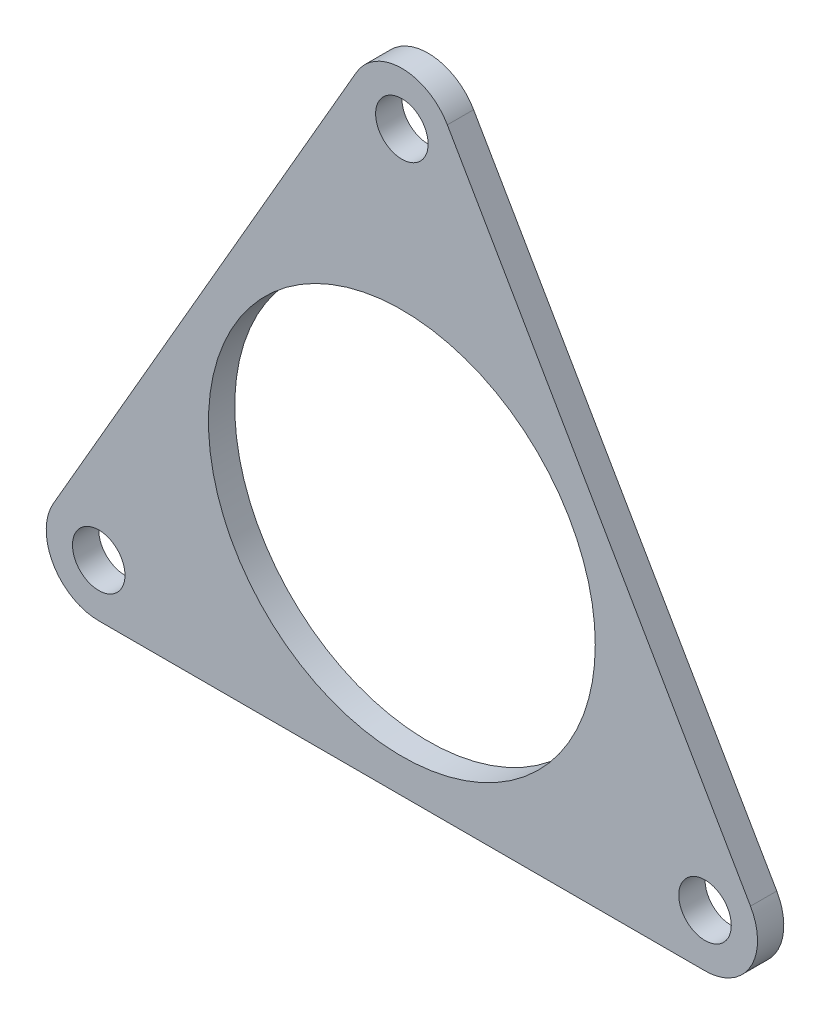
ISO-10303-21;
HEADER;
FILE_DESCRIPTION(('STEP AP214'),'2;1');
FILE_NAME('part.step','',(''),(''),'','','');
FILE_SCHEMA(('AUTOMOTIVE_DESIGN { 1 0 10303 214 1 1 1 1 }'));
ENDSEC;
DATA;
#1=APPLICATION_CONTEXT('core data for automotive mechanical design processes');
#2=APPLICATION_PROTOCOL_DEFINITION('international standard','automotive_design',2000,#1);
#3=PRODUCT_CONTEXT('',#1,'mechanical');
#4=PRODUCT('Part','Part','',(#3));
#5=PRODUCT_RELATED_PRODUCT_CATEGORY('part','',(#4));
#6=PRODUCT_DEFINITION_FORMATION('','',#4);
#7=PRODUCT_DEFINITION_CONTEXT('part definition',#1,'design');
#8=PRODUCT_DEFINITION('design','',#6,#7);
#9=PRODUCT_DEFINITION_SHAPE('','',#8);
#10=(LENGTH_UNIT() NAMED_UNIT(*) SI_UNIT(.MILLI.,.METRE.));
#11=(NAMED_UNIT(*) PLANE_ANGLE_UNIT() SI_UNIT($,.RADIAN.));
#12=(NAMED_UNIT(*) SI_UNIT($,.STERADIAN.) SOLID_ANGLE_UNIT());
#13=UNCERTAINTY_MEASURE_WITH_UNIT(LENGTH_MEASURE(1.E-05),#10,'distance_accuracy_value','');
#14=(GEOMETRIC_REPRESENTATION_CONTEXT(3) GLOBAL_UNCERTAINTY_ASSIGNED_CONTEXT((#13)) GLOBAL_UNIT_ASSIGNED_CONTEXT((#10,
#11,#12)) REPRESENTATION_CONTEXT('',''));
#15=CARTESIAN_POINT('',(0.,0.,0.));
#16=DIRECTION('',(0.,0.,1.));
#17=DIRECTION('',(1.,0.,0.));
#18=AXIS2_PLACEMENT_3D('',#15,#16,#17);
#19=CARTESIAN_POINT('',(-17.3205080756888,-9.99999999999999,1.5));
#20=DIRECTION('',(0.,0.,1.));
#21=DIRECTION('',(1.,0.,0.));
#22=AXIS2_PLACEMENT_3D('',#19,#20,#21);
#23=PLANE('',#22);
#24=CARTESIAN_POINT('',(17.3205080756888,-10.,1.5));
#25=DIRECTION('',(0.,0.,1.));
#26=DIRECTION('',(1.,0.,0.));
#27=AXIS2_PLACEMENT_3D('',#24,#25,#26);
#28=CIRCLE('',#27,1.5);
#29=CARTESIAN_POINT('',(18.8205080756888,-10.,1.5));
#30=VERTEX_POINT('',#29);
#31=EDGE_CURVE('E139',#30,#30,#28,.T.);
#32=ORIENTED_EDGE('',*,*,#31,.F.);
#33=EDGE_LOOP('',(#32));
#34=FACE_BOUND('',#33,.T.);
#35=CARTESIAN_POINT('',(-17.3205080756888,-10.,1.5));
#36=DIRECTION('',(0.,0.,1.));
#37=DIRECTION('',(1.,0.,0.));
#38=AXIS2_PLACEMENT_3D('',#35,#36,#37);
#39=CIRCLE('',#38,1.5);
#40=CARTESIAN_POINT('',(-15.8205080756888,-10.,1.5));
#41=VERTEX_POINT('',#40);
#42=EDGE_CURVE('E140',#41,#41,#39,.T.);
#43=ORIENTED_EDGE('',*,*,#42,.F.);
#44=EDGE_LOOP('',(#43));
#45=FACE_BOUND('',#44,.T.);
#46=CARTESIAN_POINT('',(-17.3205080756888,-9.99999999999999,1.5));
#47=DIRECTION('',(0.,0.,1.));
#48=DIRECTION('',(1.,0.,0.));
#49=AXIS2_PLACEMENT_3D('',#46,#47,#48);
#50=CIRCLE('',#49,3.);
#51=CARTESIAN_POINT('',(-19.9185842870421,-8.49999999999999,1.5));
#52=VERTEX_POINT('',#51);
#53=CARTESIAN_POINT('',(-17.3205080756888,-13.,1.5));
#54=VERTEX_POINT('',#53);
#55=EDGE_CURVE('E151',#52,#54,#50,.T.);
#56=ORIENTED_EDGE('',*,*,#55,.T.);
#57=DIRECTION('',(1.,0.,0.));
#58=VECTOR('',#57,1.);
#59=CARTESIAN_POINT('',(-17.3205080756888,-13.,1.5));
#60=LINE('',#59,#58);
#61=CARTESIAN_POINT('',(17.3205080756888,-13.,1.5));
#62=VERTEX_POINT('',#61);
#63=EDGE_CURVE('E89',#54,#62,#60,.T.);
#64=ORIENTED_EDGE('',*,*,#63,.T.);
#65=CARTESIAN_POINT('',(17.3205080756888,-9.99999999999999,1.5));
#66=DIRECTION('',(0.,0.,1.));
#67=DIRECTION('',(1.,0.,0.));
#68=AXIS2_PLACEMENT_3D('',#65,#66,#67);
#69=CIRCLE('',#68,3.);
#70=CARTESIAN_POINT('',(19.9185842870421,-8.49999999999999,1.5));
#71=VERTEX_POINT('',#70);
#72=EDGE_CURVE('E102',#62,#71,#69,.T.);
#73=ORIENTED_EDGE('',*,*,#72,.T.);
#74=DIRECTION('',(-0.5,0.866025403784439,0.));
#75=VECTOR('',#74,1.);
#76=CARTESIAN_POINT('',(19.9185842870421,-8.49999999999999,1.5));
#77=LINE('',#76,#75);
#78=CARTESIAN_POINT('',(2.59807621135331,21.5,1.5));
#79=VERTEX_POINT('',#78);
#80=EDGE_CURVE('E96',#71,#79,#77,.T.);
#81=ORIENTED_EDGE('',*,*,#80,.T.);
#82=CARTESIAN_POINT('',(0.,20.,1.5));
#83=DIRECTION('',(0.,0.,1.));
#84=DIRECTION('',(-1.,0.,0.));
#85=AXIS2_PLACEMENT_3D('',#82,#83,#84);
#86=CIRCLE('',#85,3.);
#87=CARTESIAN_POINT('',(-2.59807621135331,21.5,1.5));
#88=VERTEX_POINT('',#87);
#89=EDGE_CURVE('E100',#79,#88,#86,.T.);
#90=ORIENTED_EDGE('',*,*,#89,.T.);
#91=DIRECTION('',(-0.5,-0.866025403784439,0.));
#92=VECTOR('',#91,1.);
#93=CARTESIAN_POINT('',(-2.59807621135331,21.5,1.5));
#94=LINE('',#93,#92);
#95=EDGE_CURVE('E52',#88,#52,#94,.T.);
#96=ORIENTED_EDGE('',*,*,#95,.T.);
#97=EDGE_LOOP('',(#56,#64,#73,#81,#90,#96));
#98=FACE_BOUND('',#97,.T.);
#99=CARTESIAN_POINT('',(0.,20.,1.5));
#100=DIRECTION('',(0.,0.,1.));
#101=DIRECTION('',(1.,0.,0.));
#102=AXIS2_PLACEMENT_3D('',#99,#100,#101);
#103=CIRCLE('',#102,1.5);
#104=CARTESIAN_POINT('',(1.5,20.,1.5));
#105=VERTEX_POINT('',#104);
#106=EDGE_CURVE('E128',#105,#105,#103,.T.);
#107=ORIENTED_EDGE('',*,*,#106,.F.);
#108=EDGE_LOOP('',(#107));
#109=FACE_BOUND('',#108,.T.);
#110=CARTESIAN_POINT('',(0.,0.,1.5));
#111=DIRECTION('',(0.,0.,1.));
#112=DIRECTION('',(1.,0.,0.));
#113=AXIS2_PLACEMENT_3D('',#110,#111,#112);
#114=CIRCLE('',#113,11.05);
#115=CARTESIAN_POINT('',(11.05,0.,1.5));
#116=VERTEX_POINT('',#115);
#117=EDGE_CURVE('E192',#116,#116,#114,.T.);
#118=ORIENTED_EDGE('',*,*,#117,.F.);
#119=EDGE_LOOP('',(#118));
#120=FACE_BOUND('',#119,.T.);
#121=ADVANCED_FACE('F35',(#34,#45,#98,#109,#120),#23,.T.);
#122=CARTESIAN_POINT('',(-17.3205080756888,-9.99999999999999,0.));
#123=DIRECTION('',(0.,0.,1.));
#124=DIRECTION('',(1.,0.,0.));
#125=AXIS2_PLACEMENT_3D('',#122,#123,#124);
#126=PLANE('',#125);
#127=CARTESIAN_POINT('',(-17.3205080756888,-9.99999999999999,0.));
#128=DIRECTION('',(0.,0.,1.));
#129=DIRECTION('',(1.,0.,0.));
#130=AXIS2_PLACEMENT_3D('',#127,#128,#129);
#131=CIRCLE('',#130,3.);
#132=CARTESIAN_POINT('',(-19.9185842870421,-8.49999999999999,0.));
#133=VERTEX_POINT('',#132);
#134=CARTESIAN_POINT('',(-17.3205080756888,-13.,0.));
#135=VERTEX_POINT('',#134);
#136=EDGE_CURVE('E144',#133,#135,#131,.T.);
#137=ORIENTED_EDGE('',*,*,#136,.F.);
#138=DIRECTION('',(-0.5,-0.866025403784439,0.));
#139=VECTOR('',#138,1.);
#140=CARTESIAN_POINT('',(-2.59807621135331,21.5,0.));
#141=LINE('',#140,#139);
#142=CARTESIAN_POINT('',(-2.59807621135331,21.5,0.));
#143=VERTEX_POINT('',#142);
#144=EDGE_CURVE('E81',#143,#133,#141,.T.);
#145=ORIENTED_EDGE('',*,*,#144,.F.);
#146=CARTESIAN_POINT('',(0.,20.,0.));
#147=DIRECTION('',(0.,0.,1.));
#148=DIRECTION('',(-1.,0.,0.));
#149=AXIS2_PLACEMENT_3D('',#146,#147,#148);
#150=CIRCLE('',#149,3.);
#151=CARTESIAN_POINT('',(2.59807621135331,21.5,0.));
#152=VERTEX_POINT('',#151);
#153=EDGE_CURVE('E75',#152,#143,#150,.T.);
#154=ORIENTED_EDGE('',*,*,#153,.F.);
#155=DIRECTION('',(-0.5,0.866025403784439,0.));
#156=VECTOR('',#155,1.);
#157=CARTESIAN_POINT('',(19.9185842870421,-8.49999999999999,0.));
#158=LINE('',#157,#156);
#159=CARTESIAN_POINT('',(19.9185842870421,-8.49999999999999,0.));
#160=VERTEX_POINT('',#159);
#161=EDGE_CURVE('E110',#160,#152,#158,.T.);
#162=ORIENTED_EDGE('',*,*,#161,.F.);
#163=CARTESIAN_POINT('',(17.3205080756888,-9.99999999999999,0.));
#164=DIRECTION('',(0.,0.,1.));
#165=DIRECTION('',(1.,0.,0.));
#166=AXIS2_PLACEMENT_3D('',#163,#164,#165);
#167=CIRCLE('',#166,3.);
#168=CARTESIAN_POINT('',(17.3205080756888,-13.,0.));
#169=VERTEX_POINT('',#168);
#170=EDGE_CURVE('E163',#169,#160,#167,.T.);
#171=ORIENTED_EDGE('',*,*,#170,.F.);
#172=DIRECTION('',(1.,0.,0.));
#173=VECTOR('',#172,1.);
#174=CARTESIAN_POINT('',(-17.3205080756888,-13.,0.));
#175=LINE('',#174,#173);
#176=EDGE_CURVE('E159',#135,#169,#175,.T.);
#177=ORIENTED_EDGE('',*,*,#176,.F.);
#178=EDGE_LOOP('',(#137,#145,#154,#162,#171,#177));
#179=FACE_BOUND('',#178,.T.);
#180=CARTESIAN_POINT('',(-17.3205080756888,-10.,0.));
#181=DIRECTION('',(0.,0.,1.));
#182=DIRECTION('',(1.,0.,0.));
#183=AXIS2_PLACEMENT_3D('',#180,#181,#182);
#184=CIRCLE('',#183,1.5);
#185=CARTESIAN_POINT('',(-15.8205080756888,-10.,0.));
#186=VERTEX_POINT('',#185);
#187=EDGE_CURVE('E133',#186,#186,#184,.T.);
#188=ORIENTED_EDGE('',*,*,#187,.T.);
#189=EDGE_LOOP('',(#188));
#190=FACE_BOUND('',#189,.T.);
#191=CARTESIAN_POINT('',(0.,20.,0.));
#192=DIRECTION('',(0.,0.,1.));
#193=DIRECTION('',(1.,0.,0.));
#194=AXIS2_PLACEMENT_3D('',#191,#192,#193);
#195=CIRCLE('',#194,1.5);
#196=CARTESIAN_POINT('',(1.5,20.,0.));
#197=VERTEX_POINT('',#196);
#198=EDGE_CURVE('E134',#197,#197,#195,.T.);
#199=ORIENTED_EDGE('',*,*,#198,.T.);
#200=EDGE_LOOP('',(#199));
#201=FACE_BOUND('',#200,.T.);
#202=CARTESIAN_POINT('',(17.3205080756888,-10.,0.));
#203=DIRECTION('',(0.,0.,1.));
#204=DIRECTION('',(1.,0.,0.));
#205=AXIS2_PLACEMENT_3D('',#202,#203,#204);
#206=CIRCLE('',#205,1.5);
#207=CARTESIAN_POINT('',(18.8205080756888,-10.,0.));
#208=VERTEX_POINT('',#207);
#209=EDGE_CURVE('E135',#208,#208,#206,.T.);
#210=ORIENTED_EDGE('',*,*,#209,.T.);
#211=EDGE_LOOP('',(#210));
#212=FACE_BOUND('',#211,.T.);
#213=CARTESIAN_POINT('',(0.,0.,0.));
#214=DIRECTION('',(0.,0.,1.));
#215=DIRECTION('',(1.,0.,0.));
#216=AXIS2_PLACEMENT_3D('',#213,#214,#215);
#217=CIRCLE('',#216,11.05);
#218=CARTESIAN_POINT('',(11.05,0.,0.));
#219=VERTEX_POINT('',#218);
#220=EDGE_CURVE('E190',#219,#219,#217,.T.);
#221=ORIENTED_EDGE('',*,*,#220,.T.);
#222=EDGE_LOOP('',(#221));
#223=FACE_BOUND('',#222,.T.);
#224=ADVANCED_FACE('F176',(#179,#190,#201,#212,#223),#126,.F.);
#225=CARTESIAN_POINT('',(-17.3205080756888,-9.99999999999999,1.5));
#226=DIRECTION('',(0.,0.,-1.));
#227=DIRECTION('',(-1.,0.,0.));
#228=AXIS2_PLACEMENT_3D('',#225,#226,#227);
#229=CYLINDRICAL_SURFACE('',#228,3.);
#230=ORIENTED_EDGE('',*,*,#136,.T.);
#231=DIRECTION('',(0.,0.,-1.));
#232=VECTOR('',#231,1.);
#233=CARTESIAN_POINT('',(-17.3205080756888,-13.,1.5));
#234=LINE('',#233,#232);
#235=EDGE_CURVE('E12',#54,#135,#234,.T.);
#236=ORIENTED_EDGE('',*,*,#235,.F.);
#237=ORIENTED_EDGE('',*,*,#55,.F.);
#238=DIRECTION('',(0.,0.,-1.));
#239=VECTOR('',#238,1.);
#240=CARTESIAN_POINT('',(-19.9185842870421,-8.49999999999999,1.5));
#241=LINE('',#240,#239);
#242=EDGE_CURVE('E116',#52,#133,#241,.T.);
#243=ORIENTED_EDGE('',*,*,#242,.T.);
#244=EDGE_LOOP('',(#230,#236,#237,#243));
#245=FACE_BOUND('',#244,.T.);
#246=ADVANCED_FACE('F37',(#245),#229,.T.);
#247=CARTESIAN_POINT('',(-17.3205080756888,-13.,1.5));
#248=DIRECTION('',(0.,1.,0.));
#249=DIRECTION('',(0.,0.,1.));
#250=AXIS2_PLACEMENT_3D('',#247,#248,#249);
#251=PLANE('',#250);
#252=ORIENTED_EDGE('',*,*,#176,.T.);
#253=DIRECTION('',(0.,0.,-1.));
#254=VECTOR('',#253,1.);
#255=CARTESIAN_POINT('',(17.3205080756888,-13.,1.5));
#256=LINE('',#255,#254);
#257=EDGE_CURVE('E44',#62,#169,#256,.T.);
#258=ORIENTED_EDGE('',*,*,#257,.F.);
#259=ORIENTED_EDGE('',*,*,#63,.F.);
#260=ORIENTED_EDGE('',*,*,#235,.T.);
#261=EDGE_LOOP('',(#252,#258,#259,#260));
#262=FACE_BOUND('',#261,.T.);
#263=ADVANCED_FACE('F158',(#262),#251,.F.);
#264=CARTESIAN_POINT('',(17.3205080756888,-9.99999999999999,1.5));
#265=DIRECTION('',(0.,0.,-1.));
#266=DIRECTION('',(-1.,0.,0.));
#267=AXIS2_PLACEMENT_3D('',#264,#265,#266);
#268=CYLINDRICAL_SURFACE('',#267,3.);
#269=ORIENTED_EDGE('',*,*,#170,.T.);
#270=DIRECTION('',(0.,0.,-1.));
#271=VECTOR('',#270,1.);
#272=CARTESIAN_POINT('',(19.9185842870421,-8.49999999999999,1.5));
#273=LINE('',#272,#271);
#274=EDGE_CURVE('E111',#71,#160,#273,.T.);
#275=ORIENTED_EDGE('',*,*,#274,.F.);
#276=ORIENTED_EDGE('',*,*,#72,.F.);
#277=ORIENTED_EDGE('',*,*,#257,.T.);
#278=EDGE_LOOP('',(#269,#275,#276,#277));
#279=FACE_BOUND('',#278,.T.);
#280=ADVANCED_FACE('F162',(#279),#268,.T.);
#281=CARTESIAN_POINT('',(19.9185842870421,-8.49999999999999,1.5));
#282=DIRECTION('',(-0.866025403784439,-0.5,0.));
#283=DIRECTION('',(0.5,-0.866025403784439,0.));
#284=AXIS2_PLACEMENT_3D('',#281,#282,#283);
#285=PLANE('',#284);
#286=ORIENTED_EDGE('',*,*,#161,.T.);
#287=DIRECTION('',(0.,0.,-1.));
#288=VECTOR('',#287,1.);
#289=CARTESIAN_POINT('',(2.59807621135331,21.5,1.5));
#290=LINE('',#289,#288);
#291=EDGE_CURVE('E107',#79,#152,#290,.T.);
#292=ORIENTED_EDGE('',*,*,#291,.F.);
#293=ORIENTED_EDGE('',*,*,#80,.F.);
#294=ORIENTED_EDGE('',*,*,#274,.T.);
#295=EDGE_LOOP('',(#286,#292,#293,#294));
#296=FACE_BOUND('',#295,.T.);
#297=ADVANCED_FACE('F108',(#296),#285,.F.);
#298=CARTESIAN_POINT('',(0.,20.,1.5));
#299=DIRECTION('',(0.,0.,-1.));
#300=DIRECTION('',(-1.,0.,0.));
#301=AXIS2_PLACEMENT_3D('',#298,#299,#300);
#302=CYLINDRICAL_SURFACE('',#301,3.);
#303=ORIENTED_EDGE('',*,*,#153,.T.);
#304=DIRECTION('',(0.,0.,-1.));
#305=VECTOR('',#304,1.);
#306=CARTESIAN_POINT('',(-2.59807621135331,21.5,1.5));
#307=LINE('',#306,#305);
#308=EDGE_CURVE('E112',#88,#143,#307,.T.);
#309=ORIENTED_EDGE('',*,*,#308,.F.);
#310=ORIENTED_EDGE('',*,*,#89,.F.);
#311=ORIENTED_EDGE('',*,*,#291,.T.);
#312=EDGE_LOOP('',(#303,#309,#310,#311));
#313=FACE_BOUND('',#312,.T.);
#314=ADVANCED_FACE('F114',(#313),#302,.T.);
#315=CARTESIAN_POINT('',(-2.59807621135331,21.5,1.5));
#316=DIRECTION('',(0.866025403784438,-0.5,0.));
#317=DIRECTION('',(0.5,0.866025403784439,0.));
#318=AXIS2_PLACEMENT_3D('',#315,#316,#317);
#319=PLANE('',#318);
#320=ORIENTED_EDGE('',*,*,#144,.T.);
#321=ORIENTED_EDGE('',*,*,#242,.F.);
#322=ORIENTED_EDGE('',*,*,#95,.F.);
#323=ORIENTED_EDGE('',*,*,#308,.T.);
#324=EDGE_LOOP('',(#320,#321,#322,#323));
#325=FACE_BOUND('',#324,.T.);
#326=ADVANCED_FACE('F212',(#325),#319,.F.);
#327=CARTESIAN_POINT('',(-17.3205080756888,-10.,1.5));
#328=DIRECTION('',(0.,0.,-1.));
#329=DIRECTION('',(-1.,0.,0.));
#330=AXIS2_PLACEMENT_3D('',#327,#328,#329);
#331=CYLINDRICAL_SURFACE('',#330,1.5);
#332=ORIENTED_EDGE('',*,*,#42,.T.);
#333=EDGE_LOOP('',(#332));
#334=FACE_BOUND('',#333,.T.);
#335=ORIENTED_EDGE('',*,*,#187,.F.);
#336=EDGE_LOOP('',(#335));
#337=FACE_BOUND('',#336,.T.);
#338=ADVANCED_FACE('F208',(#334,#337),#331,.F.);
#339=CARTESIAN_POINT('',(0.,20.,1.5));
#340=DIRECTION('',(0.,0.,-1.));
#341=DIRECTION('',(-1.,0.,0.));
#342=AXIS2_PLACEMENT_3D('',#339,#340,#341);
#343=CYLINDRICAL_SURFACE('',#342,1.5);
#344=ORIENTED_EDGE('',*,*,#106,.T.);
#345=EDGE_LOOP('',(#344));
#346=FACE_BOUND('',#345,.T.);
#347=ORIENTED_EDGE('',*,*,#198,.F.);
#348=EDGE_LOOP('',(#347));
#349=FACE_BOUND('',#348,.T.);
#350=ADVANCED_FACE('F211',(#346,#349),#343,.F.);
#351=CARTESIAN_POINT('',(17.3205080756888,-10.,1.5));
#352=DIRECTION('',(0.,0.,-1.));
#353=DIRECTION('',(-1.,0.,0.));
#354=AXIS2_PLACEMENT_3D('',#351,#352,#353);
#355=CYLINDRICAL_SURFACE('',#354,1.5);
#356=ORIENTED_EDGE('',*,*,#31,.T.);
#357=EDGE_LOOP('',(#356));
#358=FACE_BOUND('',#357,.T.);
#359=ORIENTED_EDGE('',*,*,#209,.F.);
#360=EDGE_LOOP('',(#359));
#361=FACE_BOUND('',#360,.T.);
#362=ADVANCED_FACE('F200',(#358,#361),#355,.F.);
#363=CARTESIAN_POINT('',(0.,0.,1.5));
#364=DIRECTION('',(0.,0.,-1.));
#365=DIRECTION('',(-1.,0.,0.));
#366=AXIS2_PLACEMENT_3D('',#363,#364,#365);
#367=CYLINDRICAL_SURFACE('',#366,11.05);
#368=ORIENTED_EDGE('',*,*,#117,.T.);
#369=EDGE_LOOP('',(#368));
#370=FACE_BOUND('',#369,.T.);
#371=ORIENTED_EDGE('',*,*,#220,.F.);
#372=EDGE_LOOP('',(#371));
#373=FACE_BOUND('',#372,.T.);
#374=ADVANCED_FACE('F289',(#370,#373),#367,.F.);
#375=CLOSED_SHELL('',(#121,#224,#246,#263,#280,#297,#314,#326,#338,#350,#362,#374));
#376=MANIFOLD_SOLID_BREP('B2',#375);
#377=ADVANCED_BREP_SHAPE_REPRESENTATION('',(#18,#376),#14);
#378=SHAPE_DEFINITION_REPRESENTATION(#9,#377);
ENDSEC;
END-ISO-10303-21;
